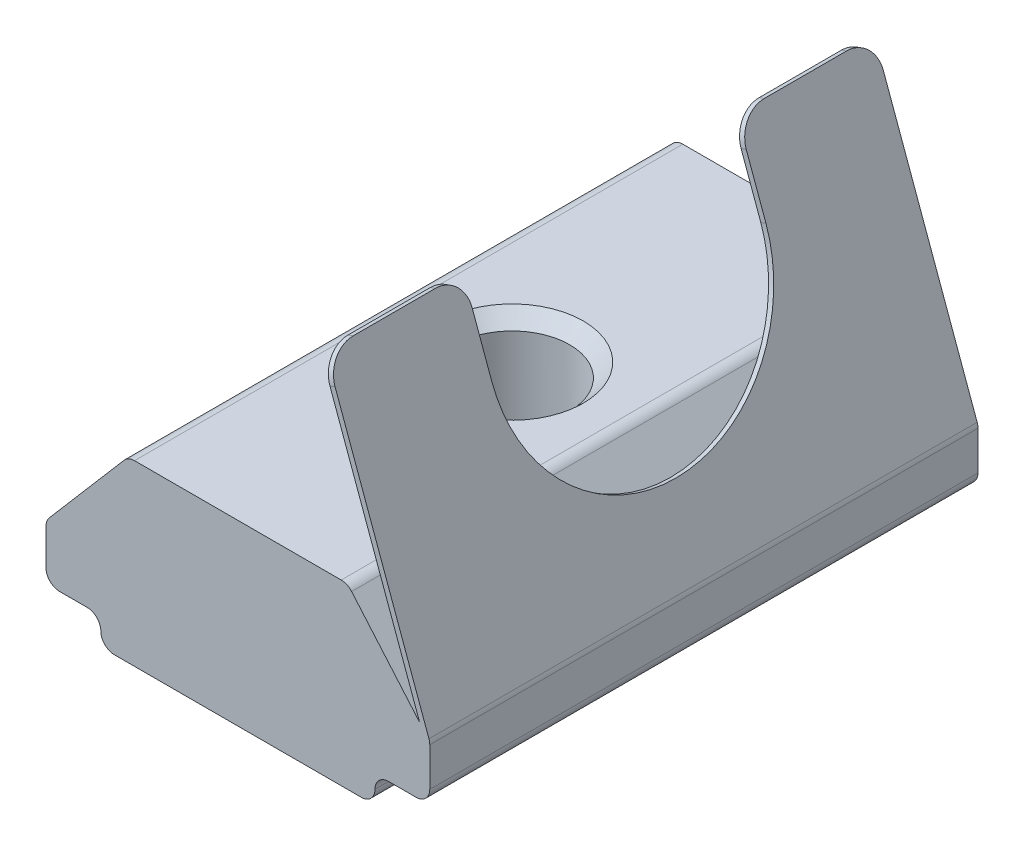
ISO-10303-21;
HEADER;
FILE_DESCRIPTION(('STEP AP214'),'2;1');
FILE_NAME('part.step','',(''),(''),'','','');
FILE_SCHEMA(('AUTOMOTIVE_DESIGN { 1 0 10303 214 1 1 1 1 }'));
ENDSEC;
DATA;
#1=APPLICATION_CONTEXT('core data for automotive mechanical design processes');
#2=APPLICATION_PROTOCOL_DEFINITION('international standard','automotive_design',2000,#1);
#3=PRODUCT_CONTEXT('',#1,'mechanical');
#4=PRODUCT('Part','Part','',(#3));
#5=PRODUCT_RELATED_PRODUCT_CATEGORY('part','',(#4));
#6=PRODUCT_DEFINITION_FORMATION('','',#4);
#7=PRODUCT_DEFINITION_CONTEXT('part definition',#1,'design');
#8=PRODUCT_DEFINITION('design','',#6,#7);
#9=PRODUCT_DEFINITION_SHAPE('','',#8);
#10=(LENGTH_UNIT() NAMED_UNIT(*) SI_UNIT(.MILLI.,.METRE.));
#11=(NAMED_UNIT(*) PLANE_ANGLE_UNIT() SI_UNIT($,.RADIAN.));
#12=(NAMED_UNIT(*) SI_UNIT($,.STERADIAN.) SOLID_ANGLE_UNIT());
#13=UNCERTAINTY_MEASURE_WITH_UNIT(LENGTH_MEASURE(1.E-05),#10,'distance_accuracy_value','');
#14=(GEOMETRIC_REPRESENTATION_CONTEXT(3) GLOBAL_UNCERTAINTY_ASSIGNED_CONTEXT((#13)) GLOBAL_UNIT_ASSIGNED_CONTEXT((#10,
#11,#12)) REPRESENTATION_CONTEXT('',''));
#15=CARTESIAN_POINT('',(0.,0.,0.));
#16=DIRECTION('',(0.,0.,1.));
#17=DIRECTION('',(1.,0.,0.));
#18=AXIS2_PLACEMENT_3D('',#15,#16,#17);
#19=CARTESIAN_POINT('',(1.98187032226132,8.92501167697695,9.01234756680424));
#20=DIRECTION('',(0.342020143325655,-0.939692620785914,0.));
#21=DIRECTION('',(0.939692620785913,0.342020143325655,0.));
#22=AXIS2_PLACEMENT_3D('',#19,#20,#21);
#23=PLANE('',#22);
#24=DIRECTION('',(0.,0.,-1.));
#25=VECTOR('',#24,1.);
#26=CARTESIAN_POINT('',(1.98187032226132,8.92501167697695,9.01234756680424));
#27=LINE('',#26,#25);
#28=CARTESIAN_POINT('',(1.98187032226132,8.92501167697695,-6.98765243319576));
#29=VERTEX_POINT('',#28);
#30=CARTESIAN_POINT('',(1.98187032226132,8.92501167697695,-9.98765243319576));
#31=VERTEX_POINT('',#30);
#32=EDGE_CURVE('E258',#29,#31,#27,.T.);
#33=ORIENTED_EDGE('',*,*,#32,.T.);
#34=DIRECTION('',(-0.939692620785913,-0.342020143325655,0.));
#35=VECTOR('',#34,1.);
#36=CARTESIAN_POINT('',(1.98187032226132,8.92501167697695,-9.98765243319576));
#37=LINE('',#36,#35);
#38=CARTESIAN_POINT('',(1.79393179810414,8.85660764831182,-9.98765243319576));
#39=VERTEX_POINT('',#38);
#40=EDGE_CURVE('E412',#31,#39,#37,.T.);
#41=ORIENTED_EDGE('',*,*,#40,.T.);
#42=DIRECTION('',(0.,0.,-1.));
#43=VECTOR('',#42,1.);
#44=CARTESIAN_POINT('',(1.79393179810414,8.85660764831182,9.01234756680424));
#45=LINE('',#44,#43);
#46=CARTESIAN_POINT('',(1.79393179810414,8.85660764831182,-6.98765243319576));
#47=VERTEX_POINT('',#46);
#48=EDGE_CURVE('E254',#47,#39,#45,.T.);
#49=ORIENTED_EDGE('',*,*,#48,.F.);
#50=DIRECTION('',(0.939692620785913,0.342020143325655,0.));
#51=VECTOR('',#50,1.);
#52=CARTESIAN_POINT('',(1.98187032226132,8.92501167697695,-6.98765243319576));
#53=LINE('',#52,#51);
#54=EDGE_CURVE('E409',#47,#29,#53,.T.);
#55=ORIENTED_EDGE('',*,*,#54,.T.);
#56=EDGE_LOOP('',(#33,#41,#49,#55));
#57=FACE_BOUND('',#56,.T.);
#58=ADVANCED_FACE('F16',(#57),#23,.F.);
#59=CARTESIAN_POINT('',(-6.22170608682381,-4.50557641374666,9.01234756680424));
#60=DIRECTION('',(0.,1.,0.));
#61=DIRECTION('',(0.,0.,1.));
#62=AXIS2_PLACEMENT_3D('',#59,#60,#61);
#63=PLANE('',#62);
#64=CARTESIAN_POINT('',(-1.22170608682381,-4.50557641374666,-0.987652433195763));
#65=DIRECTION('',(0.,1.,0.));
#66=DIRECTION('',(0.,0.,1.));
#67=AXIS2_PLACEMENT_3D('',#64,#65,#66);
#68=CIRCLE('',#67,3.1);
#69=CARTESIAN_POINT('',(-1.22170608682381,-4.50557641374666,2.11234756680424));
#70=VERTEX_POINT('',#69);
#71=EDGE_CURVE('E383',#70,#70,#68,.T.);
#72=ORIENTED_EDGE('',*,*,#71,.T.);
#73=EDGE_LOOP('',(#72));
#74=FACE_BOUND('',#73,.T.);
#75=DIRECTION('',(1.,0.,0.));
#76=VECTOR('',#75,1.);
#77=CARTESIAN_POINT('',(-6.22170608682381,-4.50557641374666,9.01234756680424));
#78=LINE('',#77,#76);
#79=CARTESIAN_POINT('',(-5.72170608682382,-4.50557641374666,9.01234756680424));
#80=VERTEX_POINT('',#79);
#81=CARTESIAN_POINT('',(3.27829391317619,-4.50557641374666,9.01234756680424));
#82=VERTEX_POINT('',#81);
#83=EDGE_CURVE('E262',#80,#82,#78,.T.);
#84=ORIENTED_EDGE('',*,*,#83,.F.);
#85=DIRECTION('',(0.,0.,-1.));
#86=VECTOR('',#85,1.);
#87=CARTESIAN_POINT('',(-5.72170608682382,-4.50557641374666,9.01234756680424));
#88=LINE('',#87,#86);
#89=CARTESIAN_POINT('',(-5.72170608682382,-4.50557641374666,-10.9876524331958));
#90=VERTEX_POINT('',#89);
#91=EDGE_CURVE('E351',#80,#90,#88,.T.);
#92=ORIENTED_EDGE('',*,*,#91,.T.);
#93=DIRECTION('',(1.,0.,0.));
#94=VECTOR('',#93,1.);
#95=CARTESIAN_POINT('',(-6.22170608682381,-4.50557641374666,-10.9876524331958));
#96=LINE('',#95,#94);
#97=CARTESIAN_POINT('',(3.27829391317619,-4.50557641374666,-10.9876524331958));
#98=VERTEX_POINT('',#97);
#99=EDGE_CURVE('E261',#90,#98,#96,.T.);
#100=ORIENTED_EDGE('',*,*,#99,.T.);
#101=DIRECTION('',(0.,0.,-1.));
#102=VECTOR('',#101,1.);
#103=CARTESIAN_POINT('',(3.27829391317619,-4.50557641374666,9.01234756680424));
#104=LINE('',#103,#102);
#105=EDGE_CURVE('E349',#98,#82,#104,.F.);
#106=ORIENTED_EDGE('',*,*,#105,.T.);
#107=EDGE_LOOP('',(#84,#92,#100,#106));
#108=FACE_BOUND('',#107,.T.);
#109=ADVANCED_FACE('F505',(#74,#108),#63,.F.);
#110=CARTESIAN_POINT('',(3.77829391317619,-3.50557641374665,9.01234756680424));
#111=DIRECTION('',(0.,1.,0.));
#112=DIRECTION('',(0.,0.,1.));
#113=AXIS2_PLACEMENT_3D('',#110,#111,#112);
#114=PLANE('',#113);
#115=DIRECTION('',(1.,0.,0.));
#116=VECTOR('',#115,1.);
#117=CARTESIAN_POINT('',(3.77829391317619,-3.50557641374665,9.01234756680424));
#118=LINE('',#117,#116);
#119=CARTESIAN_POINT('',(4.27829391317619,-3.50557641374665,9.01234756680424));
#120=VERTEX_POINT('',#119);
#121=CARTESIAN_POINT('',(5.27829391317619,-3.50557641374665,9.01234756680424));
#122=VERTEX_POINT('',#121);
#123=EDGE_CURVE('E265',#120,#122,#118,.T.);
#124=ORIENTED_EDGE('',*,*,#123,.F.);
#125=DIRECTION('',(0.,0.,-1.));
#126=VECTOR('',#125,1.);
#127=CARTESIAN_POINT('',(4.27829391317619,-3.50557641374665,-10.9876524331958));
#128=LINE('',#127,#126);
#129=CARTESIAN_POINT('',(4.27829391317619,-3.50557641374665,-10.9876524331958));
#130=VERTEX_POINT('',#129);
#131=EDGE_CURVE('E389',#120,#130,#128,.T.);
#132=ORIENTED_EDGE('',*,*,#131,.T.);
#133=DIRECTION('',(1.,0.,0.));
#134=VECTOR('',#133,1.);
#135=CARTESIAN_POINT('',(3.77829391317619,-3.50557641374665,-10.9876524331958));
#136=LINE('',#135,#134);
#137=CARTESIAN_POINT('',(5.27829391317619,-3.50557641374665,-10.9876524331958));
#138=VERTEX_POINT('',#137);
#139=EDGE_CURVE('E289',#130,#138,#136,.T.);
#140=ORIENTED_EDGE('',*,*,#139,.T.);
#141=DIRECTION('',(0.,0.,-1.));
#142=VECTOR('',#141,1.);
#143=CARTESIAN_POINT('',(5.27829391317619,-3.50557641374665,9.01234756680424));
#144=LINE('',#143,#142);
#145=EDGE_CURVE('E377',#138,#122,#144,.F.);
#146=ORIENTED_EDGE('',*,*,#145,.T.);
#147=EDGE_LOOP('',(#124,#132,#140,#146));
#148=FACE_BOUND('',#147,.T.);
#149=ADVANCED_FACE('F517',(#148),#114,.F.);
#150=CARTESIAN_POINT('',(5.77829391317619,-3.50557641374665,9.01234756680424));
#151=DIRECTION('',(-1.,0.,0.));
#152=DIRECTION('',(0.,0.,1.));
#153=AXIS2_PLACEMENT_3D('',#150,#151,#152);
#154=PLANE('',#153);
#155=DIRECTION('',(0.,1.,0.));
#156=VECTOR('',#155,1.);
#157=CARTESIAN_POINT('',(5.77829391317619,-3.50557641374665,-10.9876524331958));
#158=LINE('',#157,#156);
#159=CARTESIAN_POINT('',(5.77829391317619,-3.00557641374665,-10.9876524331958));
#160=VERTEX_POINT('',#159);
#161=CARTESIAN_POINT('',(5.77829391317619,-1.59373990410089,-10.9876524331958));
#162=VERTEX_POINT('',#161);
#163=EDGE_CURVE('E291',#160,#162,#158,.T.);
#164=ORIENTED_EDGE('',*,*,#163,.T.);
#165=DIRECTION('',(0.,0.,-1.));
#166=VECTOR('',#165,1.);
#167=CARTESIAN_POINT('',(5.77829391317619,-1.59373990410089,9.01234756680424));
#168=LINE('',#167,#166);
#169=CARTESIAN_POINT('',(5.77829391317619,-1.59373990410089,9.01234756680424));
#170=VERTEX_POINT('',#169);
#171=EDGE_CURVE('E331',#162,#170,#168,.F.);
#172=ORIENTED_EDGE('',*,*,#171,.T.);
#173=DIRECTION('',(0.,1.,0.));
#174=VECTOR('',#173,1.);
#175=CARTESIAN_POINT('',(5.77829391317619,-3.50557641374665,9.01234756680424));
#176=LINE('',#175,#174);
#177=CARTESIAN_POINT('',(5.77829391317619,-3.00557641374665,9.01234756680424));
#178=VERTEX_POINT('',#177);
#179=EDGE_CURVE('E268',#178,#170,#176,.T.);
#180=ORIENTED_EDGE('',*,*,#179,.F.);
#181=DIRECTION('',(0.,0.,-1.));
#182=VECTOR('',#181,1.);
#183=CARTESIAN_POINT('',(5.77829391317619,-3.00557641374665,9.01234756680424));
#184=LINE('',#183,#182);
#185=EDGE_CURVE('E328',#178,#160,#184,.T.);
#186=ORIENTED_EDGE('',*,*,#185,.T.);
#187=EDGE_LOOP('',(#164,#172,#180,#186));
#188=FACE_BOUND('',#187,.T.);
#189=ADVANCED_FACE('F529',(#188),#154,.F.);
#190=CARTESIAN_POINT('',(5.77829391317619,-1.50557641374665,9.01234756680424));
#191=DIRECTION('',(-0.759256602365296,-0.650791373455969,0.));
#192=DIRECTION('',(0.650791373455969,-0.759256602365296,0.));
#193=AXIS2_PLACEMENT_3D('',#190,#191,#192);
#194=PLANE('',#193);
#195=DIRECTION('',(-0.650791373455969,0.759256602365296,0.));
#196=VECTOR('',#195,1.);
#197=CARTESIAN_POINT('',(5.77829391317619,-1.50557641374665,-10.9876524331958));
#198=LINE('',#197,#196);
#199=CARTESIAN_POINT('',(5.40838190504915,-1.07401240426511,-10.9876524331958));
#200=VERTEX_POINT('',#199);
#201=CARTESIAN_POINT('',(2.92795475312363,1.81981927298133,-10.9876524331958));
#202=VERTEX_POINT('',#201);
#203=EDGE_CURVE('E294',#200,#202,#198,.T.);
#204=ORIENTED_EDGE('',*,*,#203,.T.);
#205=DIRECTION('',(0.,0.,-1.));
#206=VECTOR('',#205,1.);
#207=CARTESIAN_POINT('',(2.92795475312363,1.81981927298133,9.01234756680424));
#208=LINE('',#207,#206);
#209=CARTESIAN_POINT('',(2.92795475312363,1.81981927298133,9.01234756680424));
#210=VERTEX_POINT('',#209);
#211=EDGE_CURVE('E375',#202,#210,#208,.F.);
#212=ORIENTED_EDGE('',*,*,#211,.T.);
#213=DIRECTION('',(-0.650791373455969,0.759256602365296,0.));
#214=VECTOR('',#213,1.);
#215=CARTESIAN_POINT('',(5.77829391317619,-1.50557641374665,9.01234756680424));
#216=LINE('',#215,#214);
#217=CARTESIAN_POINT('',(5.40838190504915,-1.07401240426511,9.01234756680424));
#218=VERTEX_POINT('',#217);
#219=EDGE_CURVE('E271',#218,#210,#216,.T.);
#220=ORIENTED_EDGE('',*,*,#219,.F.);
#221=DIRECTION('',(0.,0.,-1.));
#222=VECTOR('',#221,1.);
#223=CARTESIAN_POINT('',(5.40838190504915,-1.07401240426511,9.01234756680424));
#224=LINE('',#223,#222);
#225=EDGE_CURVE('E248',#218,#200,#224,.T.);
#226=ORIENTED_EDGE('',*,*,#225,.T.);
#227=EDGE_LOOP('',(#204,#212,#220,#226));
#228=FACE_BOUND('',#227,.T.);
#229=ADVANCED_FACE('F454',(#228),#194,.F.);
#230=CARTESIAN_POINT('',(2.77829391317619,1.99442358625334,9.01234756680424));
#231=DIRECTION('',(0.,-1.,0.));
#232=DIRECTION('',(0.,0.,-1.));
#233=AXIS2_PLACEMENT_3D('',#230,#231,#232);
#234=PLANE('',#233);
#235=CARTESIAN_POINT('',(-1.22170608682381,1.99442358625334,-0.987652433195763));
#236=DIRECTION('',(0.,-1.,0.));
#237=DIRECTION('',(0.,0.,-1.));
#238=AXIS2_PLACEMENT_3D('',#235,#236,#237);
#239=CIRCLE('',#238,2.60000000000001);
#240=CARTESIAN_POINT('',(-1.22170608682381,1.99442358625334,-3.58765243319577));
#241=VERTEX_POINT('',#240);
#242=EDGE_CURVE('E405',#241,#241,#239,.T.);
#243=ORIENTED_EDGE('',*,*,#242,.T.);
#244=EDGE_LOOP('',(#243));
#245=FACE_BOUND('',#244,.T.);
#246=DIRECTION('',(-1.,0.,0.));
#247=VECTOR('',#246,1.);
#248=CARTESIAN_POINT('',(2.77829391317619,1.99442358625334,-10.9876524331958));
#249=LINE('',#248,#247);
#250=CARTESIAN_POINT('',(2.54832645194098,1.99442358625334,-10.9876524331958));
#251=VERTEX_POINT('',#250);
#252=CARTESIAN_POINT('',(-4.99173862558861,1.99442358625334,-10.9876524331958));
#253=VERTEX_POINT('',#252);
#254=EDGE_CURVE('E297',#251,#253,#249,.T.);
#255=ORIENTED_EDGE('',*,*,#254,.T.);
#256=DIRECTION('',(0.,0.,-1.));
#257=VECTOR('',#256,1.);
#258=CARTESIAN_POINT('',(-4.99173862558861,1.99442358625334,9.01234756680424));
#259=LINE('',#258,#257);
#260=CARTESIAN_POINT('',(-4.99173862558861,1.99442358625334,9.01234756680424));
#261=VERTEX_POINT('',#260);
#262=EDGE_CURVE('E373',#253,#261,#259,.F.);
#263=ORIENTED_EDGE('',*,*,#262,.T.);
#264=DIRECTION('',(-1.,0.,0.));
#265=VECTOR('',#264,1.);
#266=CARTESIAN_POINT('',(2.77829391317619,1.99442358625334,9.01234756680424));
#267=LINE('',#266,#265);
#268=CARTESIAN_POINT('',(2.54832645194098,1.99442358625334,9.01234756680424));
#269=VERTEX_POINT('',#268);
#270=EDGE_CURVE('E274',#269,#261,#267,.T.);
#271=ORIENTED_EDGE('',*,*,#270,.F.);
#272=DIRECTION('',(0.,0.,-1.));
#273=VECTOR('',#272,1.);
#274=CARTESIAN_POINT('',(2.54832645194098,1.99442358625334,9.01234756680424));
#275=LINE('',#274,#273);
#276=EDGE_CURVE('E370',#269,#251,#275,.T.);
#277=ORIENTED_EDGE('',*,*,#276,.T.);
#278=EDGE_LOOP('',(#255,#263,#271,#277));
#279=FACE_BOUND('',#278,.T.);
#280=ADVANCED_FACE('F463',(#245,#279),#234,.F.);
#281=CARTESIAN_POINT('',(-8.22170608682382,-1.50557641374665,9.01234756680424));
#282=DIRECTION('',(0.759256602365296,-0.650791373455969,0.));
#283=DIRECTION('',(0.650791373455969,0.759256602365296,0.));
#284=AXIS2_PLACEMENT_3D('',#281,#282,#283);
#285=PLANE('',#284);
#286=DIRECTION('',(-0.650791373455969,-0.759256602365296,0.));
#287=VECTOR('',#286,1.);
#288=CARTESIAN_POINT('',(-8.22170608682382,-1.50557641374665,-10.9876524331958));
#289=LINE('',#288,#287);
#290=CARTESIAN_POINT('',(-5.37136692677126,1.81981927298133,-10.9876524331958));
#291=VERTEX_POINT('',#290);
#292=CARTESIAN_POINT('',(-8.10133438800647,-1.36514276512641,-10.9876524331958));
#293=VERTEX_POINT('',#292);
#294=EDGE_CURVE('E300',#291,#293,#289,.T.);
#295=ORIENTED_EDGE('',*,*,#294,.T.);
#296=DIRECTION('',(0.,0.,-1.));
#297=VECTOR('',#296,1.);
#298=CARTESIAN_POINT('',(-8.10133438800647,-1.36514276512641,9.01234756680424));
#299=LINE('',#298,#297);
#300=CARTESIAN_POINT('',(-8.10133438800647,-1.36514276512641,9.01234756680424));
#301=VERTEX_POINT('',#300);
#302=EDGE_CURVE('E368',#293,#301,#299,.F.);
#303=ORIENTED_EDGE('',*,*,#302,.T.);
#304=DIRECTION('',(-0.650791373455969,-0.759256602365296,0.));
#305=VECTOR('',#304,1.);
#306=CARTESIAN_POINT('',(-8.22170608682382,-1.50557641374665,9.01234756680424));
#307=LINE('',#306,#305);
#308=CARTESIAN_POINT('',(-5.37136692677126,1.81981927298133,9.01234756680424));
#309=VERTEX_POINT('',#308);
#310=EDGE_CURVE('E277',#309,#301,#307,.T.);
#311=ORIENTED_EDGE('',*,*,#310,.F.);
#312=DIRECTION('',(0.,0.,-1.));
#313=VECTOR('',#312,1.);
#314=CARTESIAN_POINT('',(-5.37136692677126,1.81981927298133,9.01234756680424));
#315=LINE('',#314,#313);
#316=EDGE_CURVE('E365',#309,#291,#315,.T.);
#317=ORIENTED_EDGE('',*,*,#316,.T.);
#318=EDGE_LOOP('',(#295,#303,#311,#317));
#319=FACE_BOUND('',#318,.T.);
#320=ADVANCED_FACE('F474',(#319),#285,.F.);
#321=CARTESIAN_POINT('',(-8.22170608682381,-3.50557641374665,9.01234756680424));
#322=DIRECTION('',(1.,0.,0.));
#323=DIRECTION('',(0.,1.,0.));
#324=AXIS2_PLACEMENT_3D('',#321,#322,#323);
#325=PLANE('',#324);
#326=DIRECTION('',(0.,-1.,0.));
#327=VECTOR('',#326,1.);
#328=CARTESIAN_POINT('',(-8.22170608682381,-3.50557641374665,-10.9876524331958));
#329=LINE('',#328,#327);
#330=CARTESIAN_POINT('',(-8.22170608682382,-1.6905384518544,-10.9876524331958));
#331=VERTEX_POINT('',#330);
#332=CARTESIAN_POINT('',(-8.22170608682381,-3.00557641374666,-10.9876524331958));
#333=VERTEX_POINT('',#332);
#334=EDGE_CURVE('E303',#331,#333,#329,.T.);
#335=ORIENTED_EDGE('',*,*,#334,.T.);
#336=DIRECTION('',(0.,0.,-1.));
#337=VECTOR('',#336,1.);
#338=CARTESIAN_POINT('',(-8.22170608682381,-3.00557641374666,9.01234756680424));
#339=LINE('',#338,#337);
#340=CARTESIAN_POINT('',(-8.22170608682381,-3.00557641374666,9.01234756680424));
#341=VERTEX_POINT('',#340);
#342=EDGE_CURVE('E363',#333,#341,#339,.F.);
#343=ORIENTED_EDGE('',*,*,#342,.T.);
#344=DIRECTION('',(0.,-1.,0.));
#345=VECTOR('',#344,1.);
#346=CARTESIAN_POINT('',(-8.22170608682381,-3.50557641374665,9.01234756680424));
#347=LINE('',#346,#345);
#348=CARTESIAN_POINT('',(-8.22170608682382,-1.6905384518544,9.01234756680424));
#349=VERTEX_POINT('',#348);
#350=EDGE_CURVE('E280',#349,#341,#347,.T.);
#351=ORIENTED_EDGE('',*,*,#350,.F.);
#352=DIRECTION('',(0.,0.,-1.));
#353=VECTOR('',#352,1.);
#354=CARTESIAN_POINT('',(-8.22170608682382,-1.6905384518544,9.01234756680424));
#355=LINE('',#354,#353);
#356=EDGE_CURVE('E360',#349,#331,#355,.T.);
#357=ORIENTED_EDGE('',*,*,#356,.T.);
#358=EDGE_LOOP('',(#335,#343,#351,#357));
#359=FACE_BOUND('',#358,.T.);
#360=ADVANCED_FACE('F483',(#359),#325,.F.);
#361=CARTESIAN_POINT('',(-8.22170608682381,-3.50557641374665,9.01234756680424));
#362=DIRECTION('',(0.,1.,0.));
#363=DIRECTION('',(0.,0.,1.));
#364=AXIS2_PLACEMENT_3D('',#361,#362,#363);
#365=PLANE('',#364);
#366=DIRECTION('',(1.,0.,0.));
#367=VECTOR('',#366,1.);
#368=CARTESIAN_POINT('',(-8.22170608682381,-3.50557641374665,-10.9876524331958));
#369=LINE('',#368,#367);
#370=CARTESIAN_POINT('',(-7.72170608682382,-3.50557641374665,-10.9876524331958));
#371=VERTEX_POINT('',#370);
#372=CARTESIAN_POINT('',(-6.72170608682381,-3.50557641374665,-10.9876524331958));
#373=VERTEX_POINT('',#372);
#374=EDGE_CURVE('E266',#371,#373,#369,.T.);
#375=ORIENTED_EDGE('',*,*,#374,.T.);
#376=DIRECTION('',(0.,0.,-1.));
#377=VECTOR('',#376,1.);
#378=CARTESIAN_POINT('',(-6.72170608682381,-3.50557641374665,9.01234756680424));
#379=LINE('',#378,#377);
#380=CARTESIAN_POINT('',(-6.72170608682381,-3.50557641374665,9.01234756680424));
#381=VERTEX_POINT('',#380);
#382=EDGE_CURVE('E392',#373,#381,#379,.F.);
#383=ORIENTED_EDGE('',*,*,#382,.T.);
#384=DIRECTION('',(1.,0.,0.));
#385=VECTOR('',#384,1.);
#386=CARTESIAN_POINT('',(-8.22170608682381,-3.50557641374665,9.01234756680424));
#387=LINE('',#386,#385);
#388=CARTESIAN_POINT('',(-7.72170608682382,-3.50557641374665,9.01234756680424));
#389=VERTEX_POINT('',#388);
#390=EDGE_CURVE('E283',#389,#381,#387,.T.);
#391=ORIENTED_EDGE('',*,*,#390,.F.);
#392=DIRECTION('',(0.,0.,-1.));
#393=VECTOR('',#392,1.);
#394=CARTESIAN_POINT('',(-7.72170608682382,-3.50557641374665,9.01234756680424));
#395=LINE('',#394,#393);
#396=EDGE_CURVE('E357',#389,#371,#395,.T.);
#397=ORIENTED_EDGE('',*,*,#396,.T.);
#398=EDGE_LOOP('',(#375,#383,#391,#397));
#399=FACE_BOUND('',#398,.T.);
#400=ADVANCED_FACE('F492',(#399),#365,.F.);
#401=CARTESIAN_POINT('',(-1.22170608682381,-4.50557641374666,9.01234756680424));
#402=DIRECTION('',(0.,0.,1.));
#403=DIRECTION('',(1.,0.,0.));
#404=AXIS2_PLACEMENT_3D('',#401,#402,#403);
#405=PLANE('',#404);
#406=DIRECTION('',(-0.342020143325663,0.939692620785911,0.));
#407=VECTOR('',#406,1.);
#408=CARTESIAN_POINT('',(5.77829391317619,-1.50557641374665,9.01234756680424));
#409=LINE('',#408,#407);
#410=CARTESIAN_POINT('',(5.74814022356914,-1.42272983243806,9.01234756680424));
#411=VERTEX_POINT('',#410);
#412=CARTESIAN_POINT('',(2.32389046558699,7.98531905619104,9.01234756680424));
#413=VERTEX_POINT('',#412);
#414=EDGE_CURVE('E243',#411,#413,#409,.T.);
#415=ORIENTED_EDGE('',*,*,#414,.T.);
#416=DIRECTION('',(-0.939692620785913,-0.342020143325655,0.));
#417=VECTOR('',#416,1.);
#418=CARTESIAN_POINT('',(2.1359519414298,7.91691502752591,9.01234756680424));
#419=LINE('',#418,#417);
#420=CARTESIAN_POINT('',(2.13595194142981,7.91691502752591,9.01234756680424));
#421=VERTEX_POINT('',#420);
#422=EDGE_CURVE('E432',#413,#421,#419,.T.);
#423=ORIENTED_EDGE('',*,*,#422,.T.);
#424=DIRECTION('',(0.342020143325663,-0.93969262078591,0.));
#425=VECTOR('',#424,1.);
#426=CARTESIAN_POINT('',(1.79393179810414,8.85660764831182,9.01234756680424));
#427=LINE('',#426,#425);
#428=EDGE_CURVE('E245',#421,#218,#427,.T.);
#429=ORIENTED_EDGE('',*,*,#428,.T.);
#430=ORIENTED_EDGE('',*,*,#219,.T.);
#431=CARTESIAN_POINT('',(2.54832645194098,1.49442358625334,9.01234756680424));
#432=DIRECTION('',(0.,0.,1.));
#433=DIRECTION('',(1.,0.,0.));
#434=AXIS2_PLACEMENT_3D('',#431,#432,#433);
#435=CIRCLE('',#434,0.5);
#436=EDGE_CURVE('E337',#210,#269,#435,.T.);
#437=ORIENTED_EDGE('',*,*,#436,.T.);
#438=ORIENTED_EDGE('',*,*,#270,.T.);
#439=CARTESIAN_POINT('',(-4.99173862558861,1.49442358625334,9.01234756680424));
#440=DIRECTION('',(0.,0.,1.));
#441=DIRECTION('',(1.,0.,0.));
#442=AXIS2_PLACEMENT_3D('',#439,#440,#441);
#443=CIRCLE('',#442,0.5);
#444=EDGE_CURVE('E339',#261,#309,#443,.T.);
#445=ORIENTED_EDGE('',*,*,#444,.T.);
#446=ORIENTED_EDGE('',*,*,#310,.T.);
#447=CARTESIAN_POINT('',(-7.72170608682382,-1.6905384518544,9.01234756680424));
#448=DIRECTION('',(0.,0.,1.));
#449=DIRECTION('',(1.,0.,0.));
#450=AXIS2_PLACEMENT_3D('',#447,#448,#449);
#451=CIRCLE('',#450,0.5);
#452=EDGE_CURVE('E341',#301,#349,#451,.T.);
#453=ORIENTED_EDGE('',*,*,#452,.T.);
#454=ORIENTED_EDGE('',*,*,#350,.T.);
#455=CARTESIAN_POINT('',(-7.72170608682382,-3.00557641374665,9.01234756680424));
#456=DIRECTION('',(0.,0.,1.));
#457=DIRECTION('',(1.,0.,0.));
#458=AXIS2_PLACEMENT_3D('',#455,#456,#457);
#459=CIRCLE('',#458,0.5);
#460=EDGE_CURVE('E343',#341,#389,#459,.T.);
#461=ORIENTED_EDGE('',*,*,#460,.T.);
#462=ORIENTED_EDGE('',*,*,#390,.T.);
#463=CARTESIAN_POINT('',(-6.72170608682381,-4.00557641374666,9.01234756680424));
#464=DIRECTION('',(0.,0.,1.));
#465=DIRECTION('',(1.,0.,0.));
#466=AXIS2_PLACEMENT_3D('',#463,#464,#465);
#467=CIRCLE('',#466,0.5);
#468=CARTESIAN_POINT('',(-6.22170608682381,-4.00557641374666,9.01234756680424));
#469=VERTEX_POINT('',#468);
#470=EDGE_CURVE('E400',#381,#469,#467,.F.);
#471=ORIENTED_EDGE('',*,*,#470,.T.);
#472=CARTESIAN_POINT('',(-5.72170608682382,-4.00557641374666,9.01234756680424));
#473=DIRECTION('',(0.,0.,1.));
#474=DIRECTION('',(1.,0.,0.));
#475=AXIS2_PLACEMENT_3D('',#472,#473,#474);
#476=CIRCLE('',#475,0.5);
#477=EDGE_CURVE('E345',#469,#80,#476,.T.);
#478=ORIENTED_EDGE('',*,*,#477,.T.);
#479=ORIENTED_EDGE('',*,*,#83,.T.);
#480=CARTESIAN_POINT('',(3.27829391317619,-4.00557641374666,9.01234756680424));
#481=DIRECTION('',(0.,0.,1.));
#482=DIRECTION('',(1.,0.,0.));
#483=AXIS2_PLACEMENT_3D('',#480,#481,#482);
#484=CIRCLE('',#483,0.5);
#485=CARTESIAN_POINT('',(3.77829391317619,-4.00557641374666,9.01234756680424));
#486=VERTEX_POINT('',#485);
#487=EDGE_CURVE('E333',#82,#486,#484,.T.);
#488=ORIENTED_EDGE('',*,*,#487,.T.);
#489=CARTESIAN_POINT('',(4.27829391317619,-4.00557641374666,9.01234756680424));
#490=DIRECTION('',(0.,0.,1.));
#491=DIRECTION('',(1.,0.,0.));
#492=AXIS2_PLACEMENT_3D('',#489,#490,#491);
#493=CIRCLE('',#492,0.5);
#494=EDGE_CURVE('E396',#486,#120,#493,.F.);
#495=ORIENTED_EDGE('',*,*,#494,.T.);
#496=ORIENTED_EDGE('',*,*,#123,.T.);
#497=CARTESIAN_POINT('',(5.27829391317619,-3.00557641374665,9.01234756680424));
#498=DIRECTION('',(0.,0.,1.));
#499=DIRECTION('',(1.,0.,0.));
#500=AXIS2_PLACEMENT_3D('',#497,#498,#499);
#501=CIRCLE('',#500,0.5);
#502=EDGE_CURVE('E335',#122,#178,#501,.T.);
#503=ORIENTED_EDGE('',*,*,#502,.T.);
#504=ORIENTED_EDGE('',*,*,#179,.T.);
#505=CARTESIAN_POINT('',(5.27829391317619,-1.59373990410089,9.01234756680424));
#506=DIRECTION('',(0.,0.,1.));
#507=DIRECTION('',(1.,0.,0.));
#508=AXIS2_PLACEMENT_3D('',#505,#506,#507);
#509=CIRCLE('',#508,0.5);
#510=EDGE_CURVE('E347',#170,#411,#509,.T.);
#511=ORIENTED_EDGE('',*,*,#510,.T.);
#512=EDGE_LOOP('',(#415,#423,#429,#430,#437,#438,#445,#446,#453,#454,#461,#462,#471,#478,#479,
#488,#495,#496,#503,#504,#511));
#513=FACE_BOUND('',#512,.T.);
#514=ADVANCED_FACE('F448',(#513),#405,.T.);
#515=CARTESIAN_POINT('',(-1.22170608682381,-4.50557641374666,-10.9876524331958));
#516=DIRECTION('',(0.,0.,1.));
#517=DIRECTION('',(1.,0.,0.));
#518=AXIS2_PLACEMENT_3D('',#515,#516,#517);
#519=PLANE('',#518);
#520=DIRECTION('',(0.342020143325663,-0.93969262078591,0.));
#521=VECTOR('',#520,1.);
#522=CARTESIAN_POINT('',(1.79393179810414,8.85660764831182,-10.9876524331958));
#523=LINE('',#522,#521);
#524=CARTESIAN_POINT('',(2.13595194142981,7.91691502752591,-10.9876524331958));
#525=VERTEX_POINT('',#524);
#526=EDGE_CURVE('E246',#525,#200,#523,.T.);
#527=ORIENTED_EDGE('',*,*,#526,.F.);
#528=DIRECTION('',(-0.939692620785913,-0.342020143325655,0.));
#529=VECTOR('',#528,1.);
#530=CARTESIAN_POINT('',(-4.82144649985919,5.38462908696676,-10.9876524331958));
#531=LINE('',#530,#529);
#532=CARTESIAN_POINT('',(2.32389046558699,7.98531905619104,-10.9876524331958));
#533=VERTEX_POINT('',#532);
#534=EDGE_CURVE('E423',#525,#533,#531,.F.);
#535=ORIENTED_EDGE('',*,*,#534,.T.);
#536=DIRECTION('',(-0.342020143325663,0.939692620785911,0.));
#537=VECTOR('',#536,1.);
#538=CARTESIAN_POINT('',(5.77829391317619,-1.50557641374665,-10.9876524331958));
#539=LINE('',#538,#537);
#540=CARTESIAN_POINT('',(5.74814022356914,-1.42272983243806,-10.9876524331958));
#541=VERTEX_POINT('',#540);
#542=EDGE_CURVE('E220',#541,#533,#539,.T.);
#543=ORIENTED_EDGE('',*,*,#542,.F.);
#544=CARTESIAN_POINT('',(5.27829391317619,-1.59373990410089,-10.9876524331958));
#545=DIRECTION('',(0.,0.,1.));
#546=DIRECTION('',(1.,0.,0.));
#547=AXIS2_PLACEMENT_3D('',#544,#545,#546);
#548=CIRCLE('',#547,0.5);
#549=EDGE_CURVE('E326',#541,#162,#548,.F.);
#550=ORIENTED_EDGE('',*,*,#549,.T.);
#551=ORIENTED_EDGE('',*,*,#163,.F.);
#552=CARTESIAN_POINT('',(5.27829391317619,-3.00557641374665,-10.9876524331958));
#553=DIRECTION('',(0.,0.,1.));
#554=DIRECTION('',(1.,0.,0.));
#555=AXIS2_PLACEMENT_3D('',#552,#553,#554);
#556=CIRCLE('',#555,0.5);
#557=EDGE_CURVE('E312',#160,#138,#556,.F.);
#558=ORIENTED_EDGE('',*,*,#557,.T.);
#559=ORIENTED_EDGE('',*,*,#139,.F.);
#560=CARTESIAN_POINT('',(4.27829391317619,-4.00557641374666,-10.9876524331958));
#561=DIRECTION('',(0.,0.,1.));
#562=DIRECTION('',(1.,0.,0.));
#563=AXIS2_PLACEMENT_3D('',#560,#561,#562);
#564=CIRCLE('',#563,0.5);
#565=CARTESIAN_POINT('',(3.77829391317619,-4.00557641374666,-10.9876524331958));
#566=VERTEX_POINT('',#565);
#567=EDGE_CURVE('E394',#130,#566,#564,.T.);
#568=ORIENTED_EDGE('',*,*,#567,.T.);
#569=CARTESIAN_POINT('',(3.27829391317619,-4.00557641374666,-10.9876524331958));
#570=DIRECTION('',(0.,0.,1.));
#571=DIRECTION('',(1.,0.,0.));
#572=AXIS2_PLACEMENT_3D('',#569,#570,#571);
#573=CIRCLE('',#572,0.5);
#574=EDGE_CURVE('E310',#566,#98,#573,.F.);
#575=ORIENTED_EDGE('',*,*,#574,.T.);
#576=ORIENTED_EDGE('',*,*,#99,.F.);
#577=CARTESIAN_POINT('',(-5.72170608682382,-4.00557641374666,-10.9876524331958));
#578=DIRECTION('',(0.,0.,1.));
#579=DIRECTION('',(1.,0.,0.));
#580=AXIS2_PLACEMENT_3D('',#577,#578,#579);
#581=CIRCLE('',#580,0.5);
#582=CARTESIAN_POINT('',(-6.22170608682381,-4.00557641374666,-10.9876524331958));
#583=VERTEX_POINT('',#582);
#584=EDGE_CURVE('E323',#90,#583,#581,.F.);
#585=ORIENTED_EDGE('',*,*,#584,.T.);
#586=CARTESIAN_POINT('',(-6.72170608682381,-4.00557641374666,-10.9876524331958));
#587=DIRECTION('',(0.,0.,1.));
#588=DIRECTION('',(1.,0.,0.));
#589=AXIS2_PLACEMENT_3D('',#586,#587,#588);
#590=CIRCLE('',#589,0.5);
#591=EDGE_CURVE('E398',#583,#373,#590,.T.);
#592=ORIENTED_EDGE('',*,*,#591,.T.);
#593=ORIENTED_EDGE('',*,*,#374,.F.);
#594=CARTESIAN_POINT('',(-7.72170608682382,-3.00557641374665,-10.9876524331958));
#595=DIRECTION('',(0.,0.,1.));
#596=DIRECTION('',(1.,0.,0.));
#597=AXIS2_PLACEMENT_3D('',#594,#595,#596);
#598=CIRCLE('',#597,0.5);
#599=EDGE_CURVE('E321',#371,#333,#598,.F.);
#600=ORIENTED_EDGE('',*,*,#599,.T.);
#601=ORIENTED_EDGE('',*,*,#334,.F.);
#602=CARTESIAN_POINT('',(-7.72170608682382,-1.6905384518544,-10.9876524331958));
#603=DIRECTION('',(0.,0.,1.));
#604=DIRECTION('',(1.,0.,0.));
#605=AXIS2_PLACEMENT_3D('',#602,#603,#604);
#606=CIRCLE('',#605,0.5);
#607=EDGE_CURVE('E319',#331,#293,#606,.F.);
#608=ORIENTED_EDGE('',*,*,#607,.T.);
#609=ORIENTED_EDGE('',*,*,#294,.F.);
#610=CARTESIAN_POINT('',(-4.99173862558861,1.49442358625334,-10.9876524331958));
#611=DIRECTION('',(0.,0.,1.));
#612=DIRECTION('',(1.,0.,0.));
#613=AXIS2_PLACEMENT_3D('',#610,#611,#612);
#614=CIRCLE('',#613,0.5);
#615=EDGE_CURVE('E317',#291,#253,#614,.F.);
#616=ORIENTED_EDGE('',*,*,#615,.T.);
#617=ORIENTED_EDGE('',*,*,#254,.F.);
#618=CARTESIAN_POINT('',(2.54832645194098,1.49442358625334,-10.9876524331958));
#619=DIRECTION('',(0.,0.,1.));
#620=DIRECTION('',(1.,0.,0.));
#621=AXIS2_PLACEMENT_3D('',#618,#619,#620);
#622=CIRCLE('',#621,0.5);
#623=EDGE_CURVE('E315',#251,#202,#622,.F.);
#624=ORIENTED_EDGE('',*,*,#623,.T.);
#625=ORIENTED_EDGE('',*,*,#203,.F.);
#626=EDGE_LOOP('',(#527,#535,#543,#550,#551,#558,#559,#568,#575,#576,#585,#592,#593,#600,#601,
#608,#609,#616,#617,#624,#625));
#627=FACE_BOUND('',#626,.T.);
#628=ADVANCED_FACE('F466',(#627),#519,.F.);
#629=CARTESIAN_POINT('',(5.77829391317619,-1.50557641374665,9.01234756680424));
#630=DIRECTION('',(-0.93969262078591,-0.342020143325663,0.));
#631=DIRECTION('',(0.342020143325663,-0.939692620785911,0.));
#632=AXIS2_PLACEMENT_3D('',#629,#630,#631);
#633=PLANE('',#632);
#634=ORIENTED_EDGE('',*,*,#542,.T.);
#635=CARTESIAN_POINT('',(2.32389046558699,7.98531905619104,-9.98765243319576));
#636=DIRECTION('',(-0.93969262078591,-0.342020143325663,0.));
#637=DIRECTION('',(0.342020143325663,-0.939692620785911,0.));
#638=AXIS2_PLACEMENT_3D('',#635,#636,#637);
#639=CIRCLE('',#638,1.);
#640=EDGE_CURVE('E429',#533,#31,#639,.F.);
#641=ORIENTED_EDGE('',*,*,#640,.T.);
#642=ORIENTED_EDGE('',*,*,#32,.F.);
#643=CARTESIAN_POINT('',(2.32389046558699,7.98531905619104,-6.98765243319576));
#644=DIRECTION('',(-0.93969262078591,-0.342020143325663,0.));
#645=DIRECTION('',(0.342020143325663,-0.939692620785911,0.));
#646=AXIS2_PLACEMENT_3D('',#643,#644,#645);
#647=CIRCLE('',#646,1.);
#648=CARTESIAN_POINT('',(2.32389046558699,7.98531905619104,-5.98765243319576));
#649=VERTEX_POINT('',#648);
#650=EDGE_CURVE('E427',#29,#649,#647,.F.);
#651=ORIENTED_EDGE('',*,*,#650,.T.);
#652=DIRECTION('',(-0.342020143325663,0.93969262078591,0.));
#653=VECTOR('',#652,1.);
#654=CARTESIAN_POINT('',(1.33203204994257,10.7104276564702,-5.98765243319576));
#655=LINE('',#654,#653);
#656=CARTESIAN_POINT('',(3.04213276657088,6.01196455254063,-5.98765243319576));
#657=VERTEX_POINT('',#656);
#658=EDGE_CURVE('E235',#657,#649,#655,.T.);
#659=ORIENTED_EDGE('',*,*,#658,.F.);
#660=CARTESIAN_POINT('',(3.04213276657088,6.01196455254063,-0.987652433195763));
#661=DIRECTION('',(0.939692620785911,0.342020143325663,0.));
#662=DIRECTION('',(-0.342020143325663,0.939692620785911,0.));
#663=AXIS2_PLACEMENT_3D('',#660,#661,#662);
#664=CIRCLE('',#663,5.);
#665=CARTESIAN_POINT('',(3.04213276657088,6.01196455254063,4.01234756680424));
#666=VERTEX_POINT('',#665);
#667=EDGE_CURVE('E216',#666,#657,#664,.T.);
#668=ORIENTED_EDGE('',*,*,#667,.F.);
#669=DIRECTION('',(0.342020143325663,-0.93969262078591,0.));
#670=VECTOR('',#669,1.);
#671=CARTESIAN_POINT('',(1.33203204994257,10.7104276564702,4.01234756680424));
#672=LINE('',#671,#670);
#673=CARTESIAN_POINT('',(2.32389046558699,7.98531905619104,4.01234756680424));
#674=VERTEX_POINT('',#673);
#675=EDGE_CURVE('E239',#674,#666,#672,.T.);
#676=ORIENTED_EDGE('',*,*,#675,.F.);
#677=CARTESIAN_POINT('',(2.32389046558699,7.98531905619104,5.01234756680424));
#678=DIRECTION('',(-0.93969262078591,-0.342020143325663,0.));
#679=DIRECTION('',(0.342020143325663,-0.939692620785911,0.));
#680=AXIS2_PLACEMENT_3D('',#677,#678,#679);
#681=CIRCLE('',#680,1.);
#682=CARTESIAN_POINT('',(1.98187032226132,8.92501167697695,5.01234756680424));
#683=VERTEX_POINT('',#682);
#684=EDGE_CURVE('E37',#674,#683,#681,.F.);
#685=ORIENTED_EDGE('',*,*,#684,.T.);
#686=CARTESIAN_POINT('',(1.98187032226132,8.92501167697695,8.01234756680424));
#687=VERTEX_POINT('',#686);
#688=EDGE_CURVE('E259',#687,#683,#27,.T.);
#689=ORIENTED_EDGE('',*,*,#688,.F.);
#690=CARTESIAN_POINT('',(2.32389046558699,7.98531905619104,8.01234756680424));
#691=DIRECTION('',(-0.93969262078591,-0.342020143325663,0.));
#692=DIRECTION('',(0.342020143325663,-0.939692620785911,0.));
#693=AXIS2_PLACEMENT_3D('',#690,#691,#692);
#694=CIRCLE('',#693,1.);
#695=EDGE_CURVE('E31',#687,#413,#694,.F.);
#696=ORIENTED_EDGE('',*,*,#695,.T.);
#697=ORIENTED_EDGE('',*,*,#414,.F.);
#698=DIRECTION('',(0.,0.,-1.));
#699=VECTOR('',#698,1.);
#700=CARTESIAN_POINT('',(5.74814022356914,-1.42272983243806,9.01234756680424));
#701=LINE('',#700,#699);
#702=EDGE_CURVE('E286',#411,#541,#701,.T.);
#703=ORIENTED_EDGE('',*,*,#702,.T.);
#704=EDGE_LOOP('',(#634,#641,#642,#651,#659,#668,#676,#685,#689,#696,#697,#703));
#705=FACE_BOUND('',#704,.T.);
#706=ADVANCED_FACE('F443',(#705),#633,.F.);
#707=CARTESIAN_POINT('',(1.79393179810414,8.85660764831182,8.01234756680424));
#708=VERTEX_POINT('',#707);
#709=CARTESIAN_POINT('',(1.79393179810414,8.85660764831182,5.01234756680424));
#710=VERTEX_POINT('',#709);
#711=EDGE_CURVE('E255',#708,#710,#45,.T.);
#712=ORIENTED_EDGE('',*,*,#711,.F.);
#713=DIRECTION('',(-0.939692620785913,-0.342020143325655,0.));
#714=VECTOR('',#713,1.);
#715=CARTESIAN_POINT('',(1.98187032226132,8.92501167697695,8.01234756680424));
#716=LINE('',#715,#714);
#717=EDGE_CURVE('E24',#708,#687,#716,.F.);
#718=ORIENTED_EDGE('',*,*,#717,.T.);
#719=ORIENTED_EDGE('',*,*,#688,.T.);
#720=DIRECTION('',(-0.939692620785913,-0.342020143325655,0.));
#721=VECTOR('',#720,1.);
#722=CARTESIAN_POINT('',(1.98187032226132,8.92501167697695,5.01234756680424));
#723=LINE('',#722,#721);
#724=EDGE_CURVE('E435',#683,#710,#723,.T.);
#725=ORIENTED_EDGE('',*,*,#724,.T.);
#726=EDGE_LOOP('',(#712,#718,#719,#725));
#727=FACE_BOUND('',#726,.T.);
#728=ADVANCED_FACE('F440',(#727),#23,.F.);
#729=CARTESIAN_POINT('',(1.79393179810414,8.85660764831182,9.01234756680424));
#730=DIRECTION('',(0.93969262078591,0.342020143325663,0.));
#731=DIRECTION('',(-0.342020143325663,0.939692620785911,0.));
#732=AXIS2_PLACEMENT_3D('',#729,#730,#731);
#733=PLANE('',#732);
#734=ORIENTED_EDGE('',*,*,#48,.T.);
#735=CARTESIAN_POINT('',(2.13595194142981,7.91691502752591,-9.98765243319576));
#736=DIRECTION('',(0.93969262078591,0.342020143325663,0.));
#737=DIRECTION('',(-0.342020143325663,0.939692620785911,0.));
#738=AXIS2_PLACEMENT_3D('',#735,#736,#737);
#739=CIRCLE('',#738,1.);
#740=EDGE_CURVE('E421',#39,#525,#739,.F.);
#741=ORIENTED_EDGE('',*,*,#740,.T.);
#742=ORIENTED_EDGE('',*,*,#526,.T.);
#743=ORIENTED_EDGE('',*,*,#225,.F.);
#744=ORIENTED_EDGE('',*,*,#428,.F.);
#745=CARTESIAN_POINT('',(2.13595194142981,7.91691502752591,8.01234756680424));
#746=DIRECTION('',(0.93969262078591,0.342020143325663,0.));
#747=DIRECTION('',(-0.342020143325663,0.939692620785911,0.));
#748=AXIS2_PLACEMENT_3D('',#745,#746,#747);
#749=CIRCLE('',#748,1.);
#750=EDGE_CURVE('E417',#421,#708,#749,.F.);
#751=ORIENTED_EDGE('',*,*,#750,.T.);
#752=ORIENTED_EDGE('',*,*,#711,.T.);
#753=CARTESIAN_POINT('',(2.13595194142981,7.91691502752591,5.01234756680424));
#754=DIRECTION('',(0.93969262078591,0.342020143325663,0.));
#755=DIRECTION('',(-0.342020143325663,0.939692620785911,0.));
#756=AXIS2_PLACEMENT_3D('',#753,#754,#755);
#757=CIRCLE('',#756,1.);
#758=CARTESIAN_POINT('',(2.13595194142981,7.91691502752591,4.01234756680424));
#759=VERTEX_POINT('',#758);
#760=EDGE_CURVE('E415',#710,#759,#757,.F.);
#761=ORIENTED_EDGE('',*,*,#760,.T.);
#762=DIRECTION('',(0.342020143325663,-0.939692620785911,0.));
#763=VECTOR('',#762,1.);
#764=CARTESIAN_POINT('',(1.79393179810414,8.85660764831182,4.01234756680424));
#765=LINE('',#764,#763);
#766=CARTESIAN_POINT('',(2.8541942424137,5.9435605238755,4.01234756680424));
#767=VERTEX_POINT('',#766);
#768=EDGE_CURVE('E234',#759,#767,#765,.T.);
#769=ORIENTED_EDGE('',*,*,#768,.T.);
#770=CARTESIAN_POINT('',(2.8541942424137,5.9435605238755,-0.987652433195763));
#771=DIRECTION('',(0.939692620785911,0.342020143325663,0.));
#772=DIRECTION('',(-0.342020143325663,0.939692620785911,0.));
#773=AXIS2_PLACEMENT_3D('',#770,#771,#772);
#774=CIRCLE('',#773,5.);
#775=CARTESIAN_POINT('',(2.8541942424137,5.9435605238755,-5.98765243319576));
#776=VERTEX_POINT('',#775);
#777=EDGE_CURVE('E213',#767,#776,#774,.T.);
#778=ORIENTED_EDGE('',*,*,#777,.T.);
#779=DIRECTION('',(-0.342020143325663,0.93969262078591,0.));
#780=VECTOR('',#779,1.);
#781=CARTESIAN_POINT('',(1.14409352578538,10.6420236278051,-5.98765243319576));
#782=LINE('',#781,#780);
#783=CARTESIAN_POINT('',(2.13595194142981,7.91691502752591,-5.98765243319576));
#784=VERTEX_POINT('',#783);
#785=EDGE_CURVE('E224',#776,#784,#782,.T.);
#786=ORIENTED_EDGE('',*,*,#785,.T.);
#787=CARTESIAN_POINT('',(2.13595194142981,7.91691502752591,-6.98765243319576));
#788=DIRECTION('',(0.93969262078591,0.342020143325663,0.));
#789=DIRECTION('',(-0.342020143325663,0.939692620785911,0.));
#790=AXIS2_PLACEMENT_3D('',#787,#788,#789);
#791=CIRCLE('',#790,1.);
#792=EDGE_CURVE('E419',#784,#47,#791,.F.);
#793=ORIENTED_EDGE('',*,*,#792,.T.);
#794=EDGE_LOOP('',(#734,#741,#742,#743,#744,#751,#752,#761,#769,#778,#786,#793));
#795=FACE_BOUND('',#794,.T.);
#796=ADVANCED_FACE('F232',(#795),#733,.F.);
#797=CARTESIAN_POINT('',(5.27829391317619,-1.59373990410089,9.01234756680424));
#798=DIRECTION('',(0.,0.,-1.));
#799=DIRECTION('',(-1.,0.,0.));
#800=AXIS2_PLACEMENT_3D('',#797,#798,#799);
#801=CYLINDRICAL_SURFACE('',#800,0.5);
#802=ORIENTED_EDGE('',*,*,#510,.F.);
#803=ORIENTED_EDGE('',*,*,#171,.F.);
#804=ORIENTED_EDGE('',*,*,#549,.F.);
#805=ORIENTED_EDGE('',*,*,#702,.F.);
#806=EDGE_LOOP('',(#802,#803,#804,#805));
#807=FACE_BOUND('',#806,.T.);
#808=ADVANCED_FACE('F532',(#807),#801,.T.);
#809=CARTESIAN_POINT('',(-5.72170608682382,-4.00557641374666,9.01234756680424));
#810=DIRECTION('',(0.,0.,-1.));
#811=DIRECTION('',(-1.,0.,0.));
#812=AXIS2_PLACEMENT_3D('',#809,#810,#811);
#813=CYLINDRICAL_SURFACE('',#812,0.5);
#814=ORIENTED_EDGE('',*,*,#477,.F.);
#815=DIRECTION('',(0.,0.,-1.));
#816=VECTOR('',#815,1.);
#817=CARTESIAN_POINT('',(-6.22170608682381,-4.00557641374666,9.01234756680424));
#818=LINE('',#817,#816);
#819=EDGE_CURVE('E354',#583,#469,#818,.F.);
#820=ORIENTED_EDGE('',*,*,#819,.F.);
#821=ORIENTED_EDGE('',*,*,#584,.F.);
#822=ORIENTED_EDGE('',*,*,#91,.F.);
#823=EDGE_LOOP('',(#814,#820,#821,#822));
#824=FACE_BOUND('',#823,.T.);
#825=ADVANCED_FACE('F500',(#824),#813,.T.);
#826=CARTESIAN_POINT('',(-7.72170608682382,-3.00557641374665,9.01234756680424));
#827=DIRECTION('',(0.,0.,-1.));
#828=DIRECTION('',(-1.,0.,0.));
#829=AXIS2_PLACEMENT_3D('',#826,#827,#828);
#830=CYLINDRICAL_SURFACE('',#829,0.5);
#831=ORIENTED_EDGE('',*,*,#460,.F.);
#832=ORIENTED_EDGE('',*,*,#342,.F.);
#833=ORIENTED_EDGE('',*,*,#599,.F.);
#834=ORIENTED_EDGE('',*,*,#396,.F.);
#835=EDGE_LOOP('',(#831,#832,#833,#834));
#836=FACE_BOUND('',#835,.T.);
#837=ADVANCED_FACE('F489',(#836),#830,.T.);
#838=CARTESIAN_POINT('',(-7.72170608682382,-1.6905384518544,9.01234756680424));
#839=DIRECTION('',(0.,0.,-1.));
#840=DIRECTION('',(-1.,0.,0.));
#841=AXIS2_PLACEMENT_3D('',#838,#839,#840);
#842=CYLINDRICAL_SURFACE('',#841,0.5);
#843=ORIENTED_EDGE('',*,*,#452,.F.);
#844=ORIENTED_EDGE('',*,*,#302,.F.);
#845=ORIENTED_EDGE('',*,*,#607,.F.);
#846=ORIENTED_EDGE('',*,*,#356,.F.);
#847=EDGE_LOOP('',(#843,#844,#845,#846));
#848=FACE_BOUND('',#847,.T.);
#849=ADVANCED_FACE('F480',(#848),#842,.T.);
#850=CARTESIAN_POINT('',(-4.99173862558861,1.49442358625334,9.01234756680424));
#851=DIRECTION('',(0.,0.,-1.));
#852=DIRECTION('',(-1.,0.,0.));
#853=AXIS2_PLACEMENT_3D('',#850,#851,#852);
#854=CYLINDRICAL_SURFACE('',#853,0.5);
#855=ORIENTED_EDGE('',*,*,#444,.F.);
#856=ORIENTED_EDGE('',*,*,#262,.F.);
#857=ORIENTED_EDGE('',*,*,#615,.F.);
#858=ORIENTED_EDGE('',*,*,#316,.F.);
#859=EDGE_LOOP('',(#855,#856,#857,#858));
#860=FACE_BOUND('',#859,.T.);
#861=ADVANCED_FACE('F471',(#860),#854,.T.);
#862=CARTESIAN_POINT('',(2.54832645194098,1.49442358625334,9.01234756680424));
#863=DIRECTION('',(0.,0.,-1.));
#864=DIRECTION('',(-1.,0.,0.));
#865=AXIS2_PLACEMENT_3D('',#862,#863,#864);
#866=CYLINDRICAL_SURFACE('',#865,0.5);
#867=ORIENTED_EDGE('',*,*,#436,.F.);
#868=ORIENTED_EDGE('',*,*,#211,.F.);
#869=ORIENTED_EDGE('',*,*,#623,.F.);
#870=ORIENTED_EDGE('',*,*,#276,.F.);
#871=EDGE_LOOP('',(#867,#868,#869,#870));
#872=FACE_BOUND('',#871,.T.);
#873=ADVANCED_FACE('F460',(#872),#866,.T.);
#874=CARTESIAN_POINT('',(5.27829391317619,-3.00557641374665,9.01234756680424));
#875=DIRECTION('',(0.,0.,-1.));
#876=DIRECTION('',(-1.,0.,0.));
#877=AXIS2_PLACEMENT_3D('',#874,#875,#876);
#878=CYLINDRICAL_SURFACE('',#877,0.5);
#879=ORIENTED_EDGE('',*,*,#502,.F.);
#880=ORIENTED_EDGE('',*,*,#145,.F.);
#881=ORIENTED_EDGE('',*,*,#557,.F.);
#882=ORIENTED_EDGE('',*,*,#185,.F.);
#883=EDGE_LOOP('',(#879,#880,#881,#882));
#884=FACE_BOUND('',#883,.T.);
#885=ADVANCED_FACE('F525',(#884),#878,.T.);
#886=CARTESIAN_POINT('',(3.27829391317619,-4.00557641374666,9.01234756680424));
#887=DIRECTION('',(0.,0.,-1.));
#888=DIRECTION('',(-1.,0.,0.));
#889=AXIS2_PLACEMENT_3D('',#886,#887,#888);
#890=CYLINDRICAL_SURFACE('',#889,0.5);
#891=ORIENTED_EDGE('',*,*,#487,.F.);
#892=ORIENTED_EDGE('',*,*,#105,.F.);
#893=ORIENTED_EDGE('',*,*,#574,.F.);
#894=DIRECTION('',(0.,0.,-1.));
#895=VECTOR('',#894,1.);
#896=CARTESIAN_POINT('',(3.77829391317619,-4.00557641374666,9.01234756680424));
#897=LINE('',#896,#895);
#898=EDGE_CURVE('E380',#486,#566,#897,.T.);
#899=ORIENTED_EDGE('',*,*,#898,.F.);
#900=EDGE_LOOP('',(#891,#892,#893,#899));
#901=FACE_BOUND('',#900,.T.);
#902=ADVANCED_FACE('F510',(#901),#890,.T.);
#903=CARTESIAN_POINT('',(-1.22170608682381,-4.50557641374666,-0.987652433195763));
#904=DIRECTION('',(0.,1.,0.));
#905=DIRECTION('',(0.,0.,1.));
#906=AXIS2_PLACEMENT_3D('',#903,#904,#905);
#907=CYLINDRICAL_SURFACE('',#906,2.1);
#908=CARTESIAN_POINT('',(-1.22170608682381,1.49442358625334,-0.987652433195763));
#909=DIRECTION('',(0.,-1.,0.));
#910=DIRECTION('',(0.,0.,-1.));
#911=AXIS2_PLACEMENT_3D('',#908,#909,#910);
#912=CIRCLE('',#911,2.1);
#913=CARTESIAN_POINT('',(-1.22170608682381,1.49442358625334,-3.08765243319576));
#914=VERTEX_POINT('',#913);
#915=EDGE_CURVE('E402',#914,#914,#912,.F.);
#916=ORIENTED_EDGE('',*,*,#915,.T.);
#917=EDGE_LOOP('',(#916));
#918=FACE_BOUND('',#917,.T.);
#919=CARTESIAN_POINT('',(-1.22170608682381,-3.50557641374665,-0.987652433195763));
#920=DIRECTION('',(0.,1.,0.));
#921=DIRECTION('',(0.,0.,1.));
#922=AXIS2_PLACEMENT_3D('',#919,#920,#921);
#923=CIRCLE('',#922,2.1);
#924=CARTESIAN_POINT('',(-1.22170608682381,-3.50557641374665,1.11234756680424));
#925=VERTEX_POINT('',#924);
#926=EDGE_CURVE('E386',#925,#925,#923,.F.);
#927=ORIENTED_EDGE('',*,*,#926,.T.);
#928=EDGE_LOOP('',(#927));
#929=FACE_BOUND('',#928,.T.);
#930=ADVANCED_FACE('F614',(#918,#929),#907,.F.);
#931=CARTESIAN_POINT('',(-1.22170608682381,-4.50557641374666,-0.987652433195763));
#932=DIRECTION('',(0.,-1.,0.));
#933=DIRECTION('',(0.,0.,-1.));
#934=AXIS2_PLACEMENT_3D('',#931,#932,#933);
#935=CONICAL_SURFACE('',#934,3.1,0.785398163397447);
#936=ORIENTED_EDGE('',*,*,#926,.F.);
#937=EDGE_LOOP('',(#936));
#938=FACE_BOUND('',#937,.T.);
#939=ORIENTED_EDGE('',*,*,#71,.F.);
#940=EDGE_LOOP('',(#939));
#941=FACE_BOUND('',#940,.T.);
#942=ADVANCED_FACE('F615',(#938,#941),#935,.F.);
#943=CARTESIAN_POINT('',(4.27829391317619,-4.00557641374666,9.01234756680424));
#944=DIRECTION('',(0.,0.,1.));
#945=DIRECTION('',(1.,0.,0.));
#946=AXIS2_PLACEMENT_3D('',#943,#944,#945);
#947=CYLINDRICAL_SURFACE('',#946,0.5);
#948=ORIENTED_EDGE('',*,*,#494,.F.);
#949=ORIENTED_EDGE('',*,*,#898,.T.);
#950=ORIENTED_EDGE('',*,*,#567,.F.);
#951=ORIENTED_EDGE('',*,*,#131,.F.);
#952=EDGE_LOOP('',(#948,#949,#950,#951));
#953=FACE_BOUND('',#952,.T.);
#954=ADVANCED_FACE('F521',(#953),#947,.F.);
#955=CARTESIAN_POINT('',(-6.72170608682381,-4.00557641374666,9.01234756680424));
#956=DIRECTION('',(0.,0.,1.));
#957=DIRECTION('',(1.,0.,0.));
#958=AXIS2_PLACEMENT_3D('',#955,#956,#957);
#959=CYLINDRICAL_SURFACE('',#958,0.5);
#960=ORIENTED_EDGE('',*,*,#470,.F.);
#961=ORIENTED_EDGE('',*,*,#382,.F.);
#962=ORIENTED_EDGE('',*,*,#591,.F.);
#963=ORIENTED_EDGE('',*,*,#819,.T.);
#964=EDGE_LOOP('',(#960,#961,#962,#963));
#965=FACE_BOUND('',#964,.T.);
#966=ADVANCED_FACE('F497',(#965),#959,.F.);
#967=CARTESIAN_POINT('',(-1.22170608682381,1.49442358625334,-0.987652433195763));
#968=DIRECTION('',(0.,1.,0.));
#969=DIRECTION('',(0.,0.,1.));
#970=AXIS2_PLACEMENT_3D('',#967,#968,#969);
#971=CONICAL_SURFACE('',#970,2.1,0.785398163397451);
#972=ORIENTED_EDGE('',*,*,#242,.F.);
#973=EDGE_LOOP('',(#972));
#974=FACE_BOUND('',#973,.T.);
#975=ORIENTED_EDGE('',*,*,#915,.F.);
#976=EDGE_LOOP('',(#975));
#977=FACE_BOUND('',#976,.T.);
#978=ADVANCED_FACE('F559',(#974,#977),#971,.F.);
#979=CARTESIAN_POINT('',(1.14409352578538,10.6420236278051,-5.98765243319576));
#980=DIRECTION('',(0.,0.,-1.));
#981=DIRECTION('',(-1.,0.,0.));
#982=AXIS2_PLACEMENT_3D('',#979,#980,#981);
#983=PLANE('',#982);
#984=ORIENTED_EDGE('',*,*,#658,.T.);
#985=DIRECTION('',(0.939692620785913,0.342020143325655,0.));
#986=VECTOR('',#985,1.);
#987=CARTESIAN_POINT('',(2.13595194142978,7.9169150275259,-5.98765243319576));
#988=LINE('',#987,#986);
#989=EDGE_CURVE('E227',#649,#784,#988,.F.);
#990=ORIENTED_EDGE('',*,*,#989,.T.);
#991=ORIENTED_EDGE('',*,*,#785,.F.);
#992=DIRECTION('',(0.939692620785911,0.342020143325663,0.));
#993=VECTOR('',#992,1.);
#994=CARTESIAN_POINT('',(2.8541942424137,5.9435605238755,-5.98765243319576));
#995=LINE('',#994,#993);
#996=EDGE_CURVE('E208',#776,#657,#995,.T.);
#997=ORIENTED_EDGE('',*,*,#996,.T.);
#998=EDGE_LOOP('',(#984,#990,#991,#997));
#999=FACE_BOUND('',#998,.T.);
#1000=ADVANCED_FACE('F225',(#999),#983,.F.);
#1001=CARTESIAN_POINT('',(1.14409352578538,10.6420236278051,4.01234756680424));
#1002=DIRECTION('',(0.,0.,1.));
#1003=DIRECTION('',(1.,0.,0.));
#1004=AXIS2_PLACEMENT_3D('',#1001,#1002,#1003);
#1005=PLANE('',#1004);
#1006=ORIENTED_EDGE('',*,*,#768,.F.);
#1007=DIRECTION('',(-0.939692620785913,-0.342020143325655,0.));
#1008=VECTOR('',#1007,1.);
#1009=CARTESIAN_POINT('',(2.13595194142978,7.9169150275259,4.01234756680424));
#1010=LINE('',#1009,#1008);
#1011=EDGE_CURVE('E10',#759,#674,#1010,.F.);
#1012=ORIENTED_EDGE('',*,*,#1011,.T.);
#1013=ORIENTED_EDGE('',*,*,#675,.T.);
#1014=DIRECTION('',(0.939692620785911,0.342020143325663,0.));
#1015=VECTOR('',#1014,1.);
#1016=CARTESIAN_POINT('',(2.8541942424137,5.9435605238755,4.01234756680424));
#1017=LINE('',#1016,#1015);
#1018=EDGE_CURVE('E221',#767,#666,#1017,.T.);
#1019=ORIENTED_EDGE('',*,*,#1018,.F.);
#1020=EDGE_LOOP('',(#1006,#1012,#1013,#1019));
#1021=FACE_BOUND('',#1020,.T.);
#1022=ADVANCED_FACE('F550',(#1021),#1005,.F.);
#1023=CARTESIAN_POINT('',(2.8541942424137,5.9435605238755,-0.987652433195763));
#1024=DIRECTION('',(0.939692620785911,0.342020143325663,0.));
#1025=DIRECTION('',(-0.342020143325663,0.939692620785911,0.));
#1026=AXIS2_PLACEMENT_3D('',#1023,#1024,#1025);
#1027=CYLINDRICAL_SURFACE('',#1026,5.);
#1028=ORIENTED_EDGE('',*,*,#667,.T.);
#1029=ORIENTED_EDGE('',*,*,#996,.F.);
#1030=ORIENTED_EDGE('',*,*,#777,.F.);
#1031=ORIENTED_EDGE('',*,*,#1018,.T.);
#1032=EDGE_LOOP('',(#1028,#1029,#1030,#1031));
#1033=FACE_BOUND('',#1032,.T.);
#1034=ADVANCED_FACE('F210',(#1033),#1027,.F.);
#1035=CARTESIAN_POINT('',(2.32389046558698,7.98531905619104,-9.98765243319576));
#1036=DIRECTION('',(-0.939692620785913,-0.342020143325655,0.));
#1037=DIRECTION('',(0.342020143325655,-0.939692620785914,0.));
#1038=AXIS2_PLACEMENT_3D('',#1035,#1036,#1037);
#1039=CYLINDRICAL_SURFACE('',#1038,1.);
#1040=ORIENTED_EDGE('',*,*,#640,.F.);
#1041=ORIENTED_EDGE('',*,*,#534,.F.);
#1042=ORIENTED_EDGE('',*,*,#740,.F.);
#1043=ORIENTED_EDGE('',*,*,#40,.F.);
#1044=EDGE_LOOP('',(#1040,#1041,#1042,#1043));
#1045=FACE_BOUND('',#1044,.T.);
#1046=ADVANCED_FACE('F538',(#1045),#1039,.T.);
#1047=CARTESIAN_POINT('',(2.32389046558698,7.98531905619104,-6.98765243319576));
#1048=DIRECTION('',(0.939692620785913,0.342020143325655,0.));
#1049=DIRECTION('',(-0.342020143325655,0.939692620785914,0.));
#1050=AXIS2_PLACEMENT_3D('',#1047,#1048,#1049);
#1051=CYLINDRICAL_SURFACE('',#1050,1.);
#1052=ORIENTED_EDGE('',*,*,#792,.F.);
#1053=ORIENTED_EDGE('',*,*,#989,.F.);
#1054=ORIENTED_EDGE('',*,*,#650,.F.);
#1055=ORIENTED_EDGE('',*,*,#54,.F.);
#1056=EDGE_LOOP('',(#1052,#1053,#1054,#1055));
#1057=FACE_BOUND('',#1056,.T.);
#1058=ADVANCED_FACE('F546',(#1057),#1051,.T.);
#1059=CARTESIAN_POINT('',(-4.82144649985919,5.38462908696676,8.01234756680424));
#1060=DIRECTION('',(0.939692620785913,0.342020143325655,0.));
#1061=DIRECTION('',(-0.342020143325655,0.939692620785914,0.));
#1062=AXIS2_PLACEMENT_3D('',#1059,#1060,#1061);
#1063=CYLINDRICAL_SURFACE('',#1062,1.);
#1064=ORIENTED_EDGE('',*,*,#695,.F.);
#1065=ORIENTED_EDGE('',*,*,#717,.F.);
#1066=ORIENTED_EDGE('',*,*,#750,.F.);
#1067=ORIENTED_EDGE('',*,*,#422,.F.);
#1068=EDGE_LOOP('',(#1064,#1065,#1066,#1067));
#1069=FACE_BOUND('',#1068,.T.);
#1070=ADVANCED_FACE('F445',(#1069),#1063,.T.);
#1071=CARTESIAN_POINT('',(2.32389046558698,7.98531905619104,5.01234756680424));
#1072=DIRECTION('',(-0.939692620785913,-0.342020143325655,0.));
#1073=DIRECTION('',(0.342020143325655,-0.939692620785914,0.));
#1074=AXIS2_PLACEMENT_3D('',#1071,#1072,#1073);
#1075=CYLINDRICAL_SURFACE('',#1074,1.);
#1076=ORIENTED_EDGE('',*,*,#684,.F.);
#1077=ORIENTED_EDGE('',*,*,#1011,.F.);
#1078=ORIENTED_EDGE('',*,*,#760,.F.);
#1079=ORIENTED_EDGE('',*,*,#724,.F.);
#1080=EDGE_LOOP('',(#1076,#1077,#1078,#1079));
#1081=FACE_BOUND('',#1080,.T.);
#1082=ADVANCED_FACE('F18',(#1081),#1075,.T.);
#1083=CLOSED_SHELL('',(#58,#109,#149,#189,#229,#280,#320,#360,#400,#514,#628,#706,#728,#796,
#808,#825,#837,#849,#861,#873,#885,#902,#930,#942,#954,#966,#978,#1000,#1022,#1034,#1046,#1058,
#1070,#1082));
#1084=MANIFOLD_SOLID_BREP('B1',#1083);
#1085=ADVANCED_BREP_SHAPE_REPRESENTATION('',(#18,#1084),#14);
#1086=SHAPE_DEFINITION_REPRESENTATION(#9,#1085);
ENDSEC;
END-ISO-10303-21;
